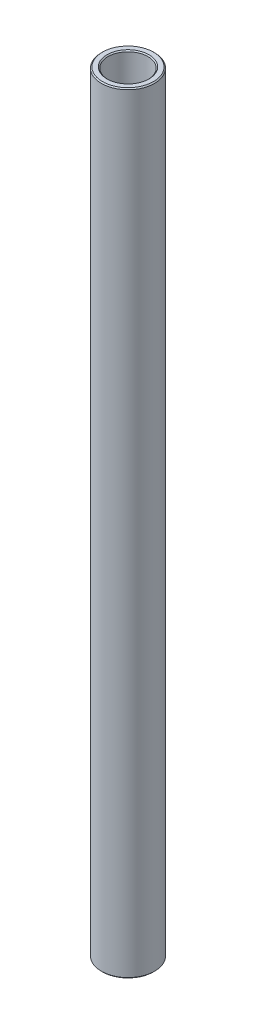
ISO-10303-21;
HEADER;
FILE_DESCRIPTION(('STEP AP214'),'2;1');
FILE_NAME('part.step','',(''),(''),'','','');
FILE_SCHEMA(('AUTOMOTIVE_DESIGN { 1 0 10303 214 1 1 1 1 }'));
ENDSEC;
DATA;
#1=APPLICATION_CONTEXT('core data for automotive mechanical design processes');
#2=APPLICATION_PROTOCOL_DEFINITION('international standard','automotive_design',2000,#1);
#3=PRODUCT_CONTEXT('',#1,'mechanical');
#4=PRODUCT('Part','Part','',(#3));
#5=PRODUCT_RELATED_PRODUCT_CATEGORY('part','',(#4));
#6=PRODUCT_DEFINITION_FORMATION('','',#4);
#7=PRODUCT_DEFINITION_CONTEXT('part definition',#1,'design');
#8=PRODUCT_DEFINITION('design','',#6,#7);
#9=PRODUCT_DEFINITION_SHAPE('','',#8);
#10=(LENGTH_UNIT() NAMED_UNIT(*) SI_UNIT(.MILLI.,.METRE.));
#11=(NAMED_UNIT(*) PLANE_ANGLE_UNIT() SI_UNIT($,.RADIAN.));
#12=(NAMED_UNIT(*) SI_UNIT($,.STERADIAN.) SOLID_ANGLE_UNIT());
#13=UNCERTAINTY_MEASURE_WITH_UNIT(LENGTH_MEASURE(1.E-05),#10,'distance_accuracy_value','');
#14=(GEOMETRIC_REPRESENTATION_CONTEXT(3) GLOBAL_UNCERTAINTY_ASSIGNED_CONTEXT((#13)) GLOBAL_UNIT_ASSIGNED_CONTEXT((#10,
#11,#12)) REPRESENTATION_CONTEXT('',''));
#15=CARTESIAN_POINT('',(0.,0.,0.));
#16=DIRECTION('',(0.,0.,1.));
#17=DIRECTION('',(1.,0.,0.));
#18=AXIS2_PLACEMENT_3D('',#15,#16,#17);
#19=CARTESIAN_POINT('',(0.,11.60859375,0.));
#20=DIRECTION('',(0.,1.,0.));
#21=DIRECTION('',(-1.,0.,0.));
#22=AXIS2_PLACEMENT_3D('',#19,#20,#21);
#23=CYLINDRICAL_SURFACE('',#22,4.76250000000001);
#24=CARTESIAN_POINT('',(0.,-91.821,0.));
#25=DIRECTION('',(0.,1.,0.));
#26=DIRECTION('',(-1.,0.,0.));
#27=AXIS2_PLACEMENT_3D('',#24,#25,#26);
#28=CIRCLE('',#27,4.76250000000001);
#29=CARTESIAN_POINT('',(-4.76250000000002,-91.821,0.));
#30=VERTEX_POINT('',#29);
#31=EDGE_CURVE('E51',#30,#30,#28,.F.);
#32=ORIENTED_EDGE('',*,*,#31,.T.);
#33=EDGE_LOOP('',(#32));
#34=FACE_BOUND('',#33,.T.);
#35=CARTESIAN_POINT('',(0.,91.821,0.));
#36=DIRECTION('',(0.,-1.,0.));
#37=DIRECTION('',(1.,0.,0.));
#38=AXIS2_PLACEMENT_3D('',#35,#36,#37);
#39=CIRCLE('',#38,4.76250000000001);
#40=CARTESIAN_POINT('',(4.76250000000002,91.821,0.));
#41=VERTEX_POINT('',#40);
#42=EDGE_CURVE('E54',#41,#41,#39,.F.);
#43=ORIENTED_EDGE('',*,*,#42,.T.);
#44=EDGE_LOOP('',(#43));
#45=FACE_BOUND('',#44,.T.);
#46=ADVANCED_FACE('F31',(#34,#45),#23,.F.);
#47=CARTESIAN_POINT('',(4.7625,92.075,0.));
#48=DIRECTION('',(0.,-1.,0.));
#49=DIRECTION('',(1.,0.,0.));
#50=AXIS2_PLACEMENT_3D('',#47,#48,#49);
#51=PLANE('',#50);
#52=CARTESIAN_POINT('',(0.,92.075,0.));
#53=DIRECTION('',(0.,-1.,0.));
#54=DIRECTION('',(1.,0.,0.));
#55=AXIS2_PLACEMENT_3D('',#52,#53,#54);
#56=CIRCLE('',#55,6.09599999999999);
#57=CARTESIAN_POINT('',(6.096,92.075,0.));
#58=VERTEX_POINT('',#57);
#59=EDGE_CURVE('E10',#58,#58,#56,.F.);
#60=ORIENTED_EDGE('',*,*,#59,.T.);
#61=EDGE_LOOP('',(#60));
#62=FACE_BOUND('',#61,.T.);
#63=CARTESIAN_POINT('',(0.,92.075,0.));
#64=DIRECTION('',(0.,-1.,0.));
#65=DIRECTION('',(1.,0.,0.));
#66=AXIS2_PLACEMENT_3D('',#63,#64,#65);
#67=CIRCLE('',#66,5.01650000000001);
#68=CARTESIAN_POINT('',(5.01650000000002,92.075,0.));
#69=VERTEX_POINT('',#68);
#70=EDGE_CURVE('E38',#69,#69,#67,.T.);
#71=ORIENTED_EDGE('',*,*,#70,.T.);
#72=EDGE_LOOP('',(#71));
#73=FACE_BOUND('',#72,.T.);
#74=ADVANCED_FACE('F77',(#62,#73),#51,.F.);
#75=CARTESIAN_POINT('',(0.,11.60859375,0.));
#76=DIRECTION('',(0.,1.,0.));
#77=DIRECTION('',(-1.,0.,0.));
#78=AXIS2_PLACEMENT_3D('',#75,#76,#77);
#79=CYLINDRICAL_SURFACE('',#78,6.35);
#80=CARTESIAN_POINT('',(0.,-91.8210000000001,0.));
#81=DIRECTION('',(0.,1.,0.));
#82=DIRECTION('',(-1.,0.,0.));
#83=AXIS2_PLACEMENT_3D('',#80,#81,#82);
#84=CIRCLE('',#83,6.35);
#85=CARTESIAN_POINT('',(-6.35000000000001,-91.8210000000001,0.));
#86=VERTEX_POINT('',#85);
#87=EDGE_CURVE('E42',#86,#86,#84,.T.);
#88=ORIENTED_EDGE('',*,*,#87,.T.);
#89=EDGE_LOOP('',(#88));
#90=FACE_BOUND('',#89,.T.);
#91=CARTESIAN_POINT('',(0.,91.821,0.));
#92=DIRECTION('',(0.,-1.,0.));
#93=DIRECTION('',(1.,0.,0.));
#94=AXIS2_PLACEMENT_3D('',#91,#92,#93);
#95=CIRCLE('',#94,6.35);
#96=CARTESIAN_POINT('',(6.35000000000001,91.821,0.));
#97=VERTEX_POINT('',#96);
#98=EDGE_CURVE('E46',#97,#97,#95,.T.);
#99=ORIENTED_EDGE('',*,*,#98,.T.);
#100=EDGE_LOOP('',(#99));
#101=FACE_BOUND('',#100,.T.);
#102=ADVANCED_FACE('F74',(#90,#101),#79,.T.);
#103=CARTESIAN_POINT('',(6.35000000000001,-92.075,0.));
#104=DIRECTION('',(0.,1.,0.));
#105=DIRECTION('',(-1.,0.,0.));
#106=AXIS2_PLACEMENT_3D('',#103,#104,#105);
#107=PLANE('',#106);
#108=CARTESIAN_POINT('',(0.,-92.075,0.));
#109=DIRECTION('',(0.,1.,0.));
#110=DIRECTION('',(-1.,0.,0.));
#111=AXIS2_PLACEMENT_3D('',#108,#109,#110);
#112=CIRCLE('',#111,5.01650000000003);
#113=CARTESIAN_POINT('',(-5.01650000000004,-92.075,0.));
#114=VERTEX_POINT('',#113);
#115=EDGE_CURVE('E57',#114,#114,#112,.T.);
#116=ORIENTED_EDGE('',*,*,#115,.T.);
#117=EDGE_LOOP('',(#116));
#118=FACE_BOUND('',#117,.T.);
#119=CARTESIAN_POINT('',(0.,-92.075,0.));
#120=DIRECTION('',(0.,1.,0.));
#121=DIRECTION('',(-1.,0.,0.));
#122=AXIS2_PLACEMENT_3D('',#119,#120,#121);
#123=CIRCLE('',#122,6.09600000000007);
#124=CARTESIAN_POINT('',(-6.09600000000008,-92.075,0.));
#125=VERTEX_POINT('',#124);
#126=EDGE_CURVE('E60',#125,#125,#123,.F.);
#127=ORIENTED_EDGE('',*,*,#126,.T.);
#128=EDGE_LOOP('',(#127));
#129=FACE_BOUND('',#128,.T.);
#130=ADVANCED_FACE('F64',(#118,#129),#107,.F.);
#131=CARTESIAN_POINT('',(0.,-92.075,0.));
#132=DIRECTION('',(0.,-1.,0.));
#133=DIRECTION('',(1.,0.,0.));
#134=AXIS2_PLACEMENT_3D('',#131,#132,#133);
#135=CONICAL_SURFACE('',#134,5.01650000000003,0.785398163397491);
#136=ORIENTED_EDGE('',*,*,#31,.F.);
#137=EDGE_LOOP('',(#136));
#138=FACE_BOUND('',#137,.T.);
#139=ORIENTED_EDGE('',*,*,#115,.F.);
#140=EDGE_LOOP('',(#139));
#141=FACE_BOUND('',#140,.T.);
#142=ADVANCED_FACE('F70',(#138,#141),#135,.F.);
#143=CARTESIAN_POINT('',(0.,-91.8210000000001,0.));
#144=DIRECTION('',(0.,1.,0.));
#145=DIRECTION('',(-1.,0.,0.));
#146=AXIS2_PLACEMENT_3D('',#143,#144,#145);
#147=CONICAL_SURFACE('',#146,6.35,0.785398163397488);
#148=ORIENTED_EDGE('',*,*,#126,.F.);
#149=EDGE_LOOP('',(#148));
#150=FACE_BOUND('',#149,.T.);
#151=ORIENTED_EDGE('',*,*,#87,.F.);
#152=EDGE_LOOP('',(#151));
#153=FACE_BOUND('',#152,.T.);
#154=ADVANCED_FACE('F66',(#150,#153),#147,.T.);
#155=CARTESIAN_POINT('',(0.,92.075,0.));
#156=DIRECTION('',(0.,-1.,0.));
#157=DIRECTION('',(1.,0.,0.));
#158=AXIS2_PLACEMENT_3D('',#155,#156,#157);
#159=CONICAL_SURFACE('',#158,6.09599999999999,0.78539816339746);
#160=ORIENTED_EDGE('',*,*,#98,.F.);
#161=EDGE_LOOP('',(#160));
#162=FACE_BOUND('',#161,.T.);
#163=ORIENTED_EDGE('',*,*,#59,.F.);
#164=EDGE_LOOP('',(#163));
#165=FACE_BOUND('',#164,.T.);
#166=ADVANCED_FACE('F69',(#162,#165),#159,.T.);
#167=CARTESIAN_POINT('',(0.,91.821,0.));
#168=DIRECTION('',(0.,1.,0.));
#169=DIRECTION('',(-1.,0.,0.));
#170=AXIS2_PLACEMENT_3D('',#167,#168,#169);
#171=CONICAL_SURFACE('',#170,4.76250000000001,0.785398163397436);
#172=ORIENTED_EDGE('',*,*,#70,.F.);
#173=EDGE_LOOP('',(#172));
#174=FACE_BOUND('',#173,.T.);
#175=ORIENTED_EDGE('',*,*,#42,.F.);
#176=EDGE_LOOP('',(#175));
#177=FACE_BOUND('',#176,.T.);
#178=ADVANCED_FACE('F33',(#174,#177),#171,.F.);
#179=CLOSED_SHELL('',(#46,#74,#102,#130,#142,#154,#166,#178));
#180=MANIFOLD_SOLID_BREP('B2',#179);
#181=ADVANCED_BREP_SHAPE_REPRESENTATION('',(#18,#180),#14);
#182=SHAPE_DEFINITION_REPRESENTATION(#9,#181);
ENDSEC;
END-ISO-10303-21;
